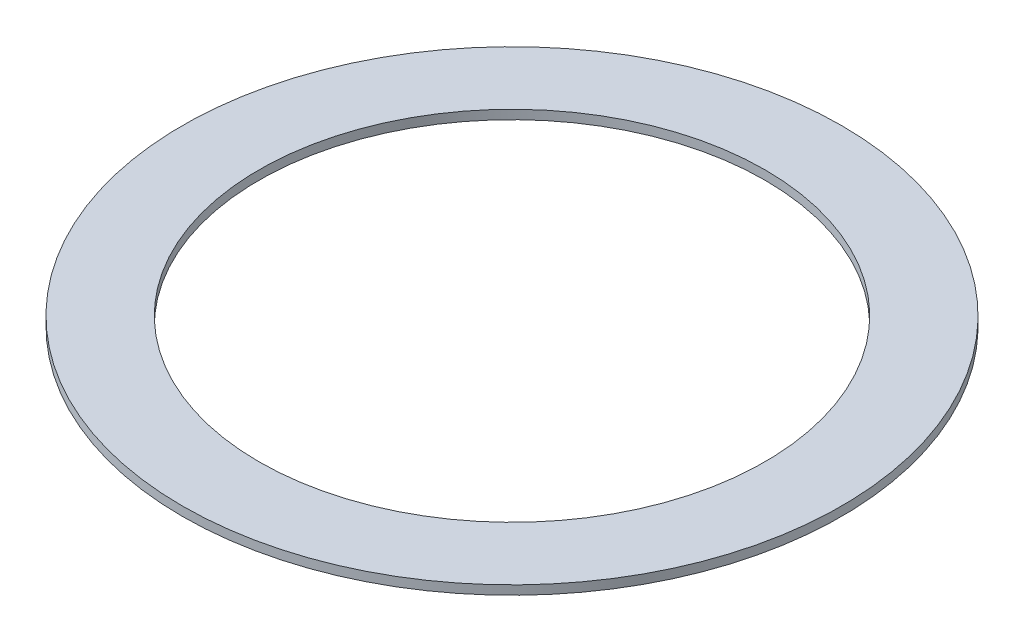
ISO-10303-21;
HEADER;
FILE_DESCRIPTION(('STEP AP214'),'2;1');
FILE_NAME('part.step','',(''),(''),'','','');
FILE_SCHEMA(('AUTOMOTIVE_DESIGN { 1 0 10303 214 1 1 1 1 }'));
ENDSEC;
DATA;
#1=APPLICATION_CONTEXT('core data for automotive mechanical design processes');
#2=APPLICATION_PROTOCOL_DEFINITION('international standard','automotive_design',2000,#1);
#3=PRODUCT_CONTEXT('',#1,'mechanical');
#4=PRODUCT('Part','Part','',(#3));
#5=PRODUCT_RELATED_PRODUCT_CATEGORY('part','',(#4));
#6=PRODUCT_DEFINITION_FORMATION('','',#4);
#7=PRODUCT_DEFINITION_CONTEXT('part definition',#1,'design');
#8=PRODUCT_DEFINITION('design','',#6,#7);
#9=PRODUCT_DEFINITION_SHAPE('','',#8);
#10=(LENGTH_UNIT() NAMED_UNIT(*) SI_UNIT(.MILLI.,.METRE.));
#11=(NAMED_UNIT(*) PLANE_ANGLE_UNIT() SI_UNIT($,.RADIAN.));
#12=(NAMED_UNIT(*) SI_UNIT($,.STERADIAN.) SOLID_ANGLE_UNIT());
#13=UNCERTAINTY_MEASURE_WITH_UNIT(LENGTH_MEASURE(1.E-05),#10,'distance_accuracy_value','');
#14=(GEOMETRIC_REPRESENTATION_CONTEXT(3) GLOBAL_UNCERTAINTY_ASSIGNED_CONTEXT((#13)) GLOBAL_UNIT_ASSIGNED_CONTEXT((#10,
#11,#12)) REPRESENTATION_CONTEXT('',''));
#15=CARTESIAN_POINT('',(0.,0.,0.));
#16=DIRECTION('',(0.,0.,1.));
#17=DIRECTION('',(1.,0.,0.));
#18=AXIS2_PLACEMENT_3D('',#15,#16,#17);
#19=CARTESIAN_POINT('',(0.,3.175,0.));
#20=DIRECTION('',(0.,1.,0.));
#21=DIRECTION('',(0.,0.,1.));
#22=AXIS2_PLACEMENT_3D('',#19,#20,#21);
#23=PLANE('',#22);
#24=CARTESIAN_POINT('',(0.,3.175,0.));
#25=DIRECTION('',(0.,1.,0.));
#26=DIRECTION('',(0.,0.,1.));
#27=AXIS2_PLACEMENT_3D('',#24,#25,#26);
#28=CIRCLE('',#27,115.824);
#29=CARTESIAN_POINT('',(0.,3.175,115.824));
#30=VERTEX_POINT('',#29);
#31=EDGE_CURVE('E10',#30,#30,#28,.T.);
#32=ORIENTED_EDGE('',*,*,#31,.T.);
#33=EDGE_LOOP('',(#32));
#34=FACE_BOUND('',#33,.T.);
#35=CARTESIAN_POINT('',(0.,3.175,0.));
#36=DIRECTION('',(0.,1.,0.));
#37=DIRECTION('',(0.,0.,1.));
#38=AXIS2_PLACEMENT_3D('',#35,#36,#37);
#39=CIRCLE('',#38,88.9);
#40=CARTESIAN_POINT('',(0.,3.175,88.9));
#41=VERTEX_POINT('',#40);
#42=EDGE_CURVE('E45',#41,#41,#39,.T.);
#43=ORIENTED_EDGE('',*,*,#42,.F.);
#44=EDGE_LOOP('',(#43));
#45=FACE_BOUND('',#44,.T.);
#46=ADVANCED_FACE('F34',(#34,#45),#23,.T.);
#47=CARTESIAN_POINT('',(0.,0.,0.));
#48=DIRECTION('',(0.,1.,0.));
#49=DIRECTION('',(0.,0.,1.));
#50=AXIS2_PLACEMENT_3D('',#47,#48,#49);
#51=PLANE('',#50);
#52=CARTESIAN_POINT('',(0.,0.,0.));
#53=DIRECTION('',(0.,1.,0.));
#54=DIRECTION('',(0.,0.,1.));
#55=AXIS2_PLACEMENT_3D('',#52,#53,#54);
#56=CIRCLE('',#55,115.824);
#57=CARTESIAN_POINT('',(0.,0.,115.824));
#58=VERTEX_POINT('',#57);
#59=EDGE_CURVE('E38',#58,#58,#56,.T.);
#60=ORIENTED_EDGE('',*,*,#59,.F.);
#61=EDGE_LOOP('',(#60));
#62=FACE_BOUND('',#61,.T.);
#63=CARTESIAN_POINT('',(0.,0.,0.));
#64=DIRECTION('',(0.,1.,0.));
#65=DIRECTION('',(0.,0.,1.));
#66=AXIS2_PLACEMENT_3D('',#63,#64,#65);
#67=CIRCLE('',#66,88.9);
#68=CARTESIAN_POINT('',(0.,0.,88.9));
#69=VERTEX_POINT('',#68);
#70=EDGE_CURVE('E47',#69,#69,#67,.T.);
#71=ORIENTED_EDGE('',*,*,#70,.T.);
#72=EDGE_LOOP('',(#71));
#73=FACE_BOUND('',#72,.T.);
#74=ADVANCED_FACE('F57',(#62,#73),#51,.F.);
#75=CARTESIAN_POINT('',(0.,3.175,0.));
#76=DIRECTION('',(0.,-1.,0.));
#77=DIRECTION('',(0.,0.,-1.));
#78=AXIS2_PLACEMENT_3D('',#75,#76,#77);
#79=CYLINDRICAL_SURFACE('',#78,115.824);
#80=ORIENTED_EDGE('',*,*,#31,.F.);
#81=EDGE_LOOP('',(#80));
#82=FACE_BOUND('',#81,.T.);
#83=ORIENTED_EDGE('',*,*,#59,.T.);
#84=EDGE_LOOP('',(#83));
#85=FACE_BOUND('',#84,.T.);
#86=ADVANCED_FACE('F36',(#82,#85),#79,.T.);
#87=CARTESIAN_POINT('',(0.,3.175,0.));
#88=DIRECTION('',(0.,-1.,0.));
#89=DIRECTION('',(0.,0.,-1.));
#90=AXIS2_PLACEMENT_3D('',#87,#88,#89);
#91=CYLINDRICAL_SURFACE('',#90,88.9);
#92=ORIENTED_EDGE('',*,*,#42,.T.);
#93=EDGE_LOOP('',(#92));
#94=FACE_BOUND('',#93,.T.);
#95=ORIENTED_EDGE('',*,*,#70,.F.);
#96=EDGE_LOOP('',(#95));
#97=FACE_BOUND('',#96,.T.);
#98=ADVANCED_FACE('F53',(#94,#97),#91,.F.);
#99=CLOSED_SHELL('',(#46,#74,#86,#98));
#100=MANIFOLD_SOLID_BREP('B2',#99);
#101=ADVANCED_BREP_SHAPE_REPRESENTATION('',(#18,#100),#14);
#102=SHAPE_DEFINITION_REPRESENTATION(#9,#101);
ENDSEC;
END-ISO-10303-21;
